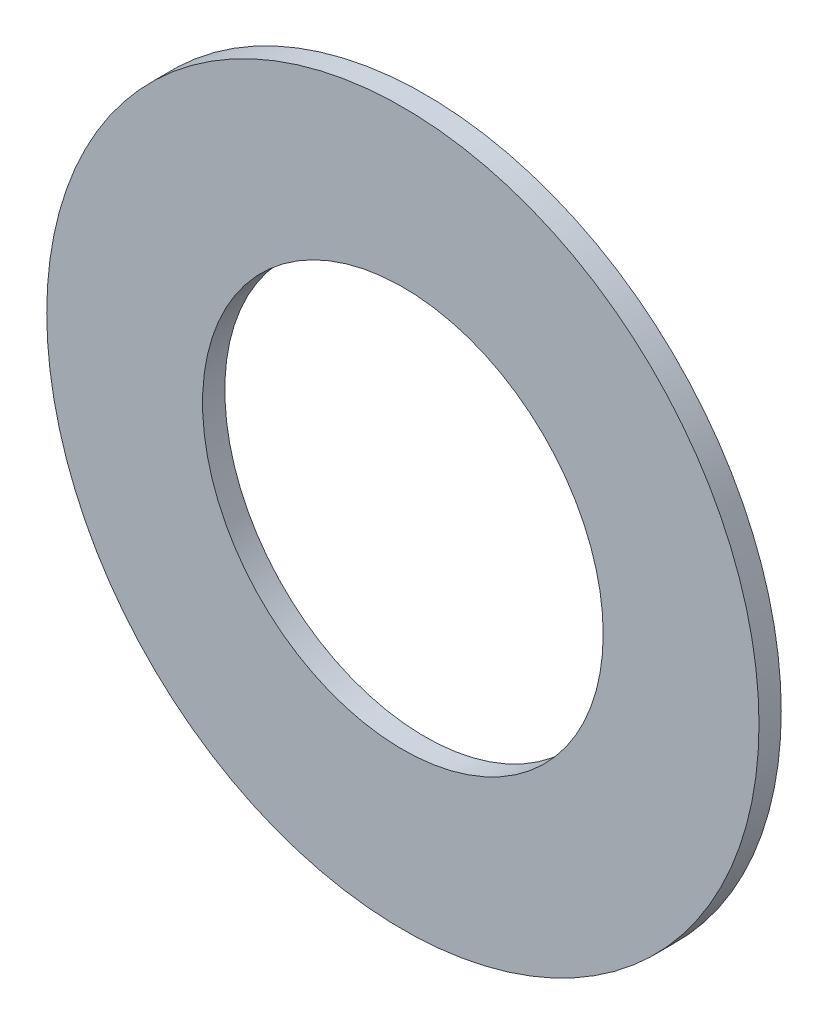
ISO-10303-21;
HEADER;
FILE_DESCRIPTION(('STEP AP214'),'2;1');
FILE_NAME('part.step','',(''),(''),'','','');
FILE_SCHEMA(('AUTOMOTIVE_DESIGN { 1 0 10303 214 1 1 1 1 }'));
ENDSEC;
DATA;
#1=APPLICATION_CONTEXT('core data for automotive mechanical design processes');
#2=APPLICATION_PROTOCOL_DEFINITION('international standard','automotive_design',2000,#1);
#3=PRODUCT_CONTEXT('',#1,'mechanical');
#4=PRODUCT('Part','Part','',(#3));
#5=PRODUCT_RELATED_PRODUCT_CATEGORY('part','',(#4));
#6=PRODUCT_DEFINITION_FORMATION('','',#4);
#7=PRODUCT_DEFINITION_CONTEXT('part definition',#1,'design');
#8=PRODUCT_DEFINITION('design','',#6,#7);
#9=PRODUCT_DEFINITION_SHAPE('','',#8);
#10=(LENGTH_UNIT() NAMED_UNIT(*) SI_UNIT(.MILLI.,.METRE.));
#11=(NAMED_UNIT(*) PLANE_ANGLE_UNIT() SI_UNIT($,.RADIAN.));
#12=(NAMED_UNIT(*) SI_UNIT($,.STERADIAN.) SOLID_ANGLE_UNIT());
#13=UNCERTAINTY_MEASURE_WITH_UNIT(LENGTH_MEASURE(1.E-05),#10,'distance_accuracy_value','');
#14=(GEOMETRIC_REPRESENTATION_CONTEXT(3) GLOBAL_UNCERTAINTY_ASSIGNED_CONTEXT((#13)) GLOBAL_UNIT_ASSIGNED_CONTEXT((#10,
#11,#12)) REPRESENTATION_CONTEXT('',''));
#15=CARTESIAN_POINT('',(0.,0.,0.));
#16=DIRECTION('',(0.,0.,1.));
#17=DIRECTION('',(1.,0.,0.));
#18=AXIS2_PLACEMENT_3D('',#15,#16,#17);
#19=CARTESIAN_POINT('',(0.,0.,0.5));
#20=DIRECTION('',(0.,0.,1.));
#21=DIRECTION('',(1.,0.,0.));
#22=AXIS2_PLACEMENT_3D('',#19,#20,#21);
#23=PLANE('',#22);
#24=CARTESIAN_POINT('',(0.,0.,0.5));
#25=DIRECTION('',(0.,0.,1.));
#26=DIRECTION('',(1.,0.,0.));
#27=AXIS2_PLACEMENT_3D('',#24,#25,#26);
#28=CIRCLE('',#27,8.);
#29=CARTESIAN_POINT('',(8.,0.,0.5));
#30=VERTEX_POINT('',#29);
#31=EDGE_CURVE('E10',#30,#30,#28,.T.);
#32=ORIENTED_EDGE('',*,*,#31,.T.);
#33=EDGE_LOOP('',(#32));
#34=FACE_BOUND('',#33,.T.);
#35=CARTESIAN_POINT('',(0.,0.,0.5));
#36=DIRECTION('',(0.,0.,1.));
#37=DIRECTION('',(1.,0.,0.));
#38=AXIS2_PLACEMENT_3D('',#35,#36,#37);
#39=CIRCLE('',#38,4.5);
#40=CARTESIAN_POINT('',(4.5,0.,0.5));
#41=VERTEX_POINT('',#40);
#42=EDGE_CURVE('E41',#41,#41,#39,.T.);
#43=ORIENTED_EDGE('',*,*,#42,.F.);
#44=EDGE_LOOP('',(#43));
#45=FACE_BOUND('',#44,.T.);
#46=ADVANCED_FACE('F30',(#34,#45),#23,.T.);
#47=CARTESIAN_POINT('',(0.,0.,0.));
#48=DIRECTION('',(0.,0.,1.));
#49=DIRECTION('',(1.,0.,0.));
#50=AXIS2_PLACEMENT_3D('',#47,#48,#49);
#51=PLANE('',#50);
#52=CARTESIAN_POINT('',(0.,0.,0.));
#53=DIRECTION('',(0.,0.,1.));
#54=DIRECTION('',(1.,0.,0.));
#55=AXIS2_PLACEMENT_3D('',#52,#53,#54);
#56=CIRCLE('',#55,8.);
#57=CARTESIAN_POINT('',(8.,0.,0.));
#58=VERTEX_POINT('',#57);
#59=EDGE_CURVE('E34',#58,#58,#56,.T.);
#60=ORIENTED_EDGE('',*,*,#59,.F.);
#61=EDGE_LOOP('',(#60));
#62=FACE_BOUND('',#61,.T.);
#63=CARTESIAN_POINT('',(0.,0.,0.));
#64=DIRECTION('',(0.,0.,1.));
#65=DIRECTION('',(1.,0.,0.));
#66=AXIS2_PLACEMENT_3D('',#63,#64,#65);
#67=CIRCLE('',#66,4.5);
#68=CARTESIAN_POINT('',(4.5,0.,0.));
#69=VERTEX_POINT('',#68);
#70=EDGE_CURVE('E43',#69,#69,#67,.T.);
#71=ORIENTED_EDGE('',*,*,#70,.T.);
#72=EDGE_LOOP('',(#71));
#73=FACE_BOUND('',#72,.T.);
#74=ADVANCED_FACE('F53',(#62,#73),#51,.F.);
#75=CARTESIAN_POINT('',(0.,0.,0.5));
#76=DIRECTION('',(0.,0.,-1.));
#77=DIRECTION('',(-1.,0.,0.));
#78=AXIS2_PLACEMENT_3D('',#75,#76,#77);
#79=CYLINDRICAL_SURFACE('',#78,8.);
#80=ORIENTED_EDGE('',*,*,#31,.F.);
#81=EDGE_LOOP('',(#80));
#82=FACE_BOUND('',#81,.T.);
#83=ORIENTED_EDGE('',*,*,#59,.T.);
#84=EDGE_LOOP('',(#83));
#85=FACE_BOUND('',#84,.T.);
#86=ADVANCED_FACE('F32',(#82,#85),#79,.T.);
#87=CARTESIAN_POINT('',(0.,0.,0.5));
#88=DIRECTION('',(0.,0.,-1.));
#89=DIRECTION('',(-1.,0.,0.));
#90=AXIS2_PLACEMENT_3D('',#87,#88,#89);
#91=CYLINDRICAL_SURFACE('',#90,4.5);
#92=ORIENTED_EDGE('',*,*,#42,.T.);
#93=EDGE_LOOP('',(#92));
#94=FACE_BOUND('',#93,.T.);
#95=ORIENTED_EDGE('',*,*,#70,.F.);
#96=EDGE_LOOP('',(#95));
#97=FACE_BOUND('',#96,.T.);
#98=ADVANCED_FACE('F49',(#94,#97),#91,.F.);
#99=CLOSED_SHELL('',(#46,#74,#86,#98));
#100=MANIFOLD_SOLID_BREP('B2',#99);
#101=ADVANCED_BREP_SHAPE_REPRESENTATION('',(#18,#100),#14);
#102=SHAPE_DEFINITION_REPRESENTATION(#9,#101);
ENDSEC;
END-ISO-10303-21;
